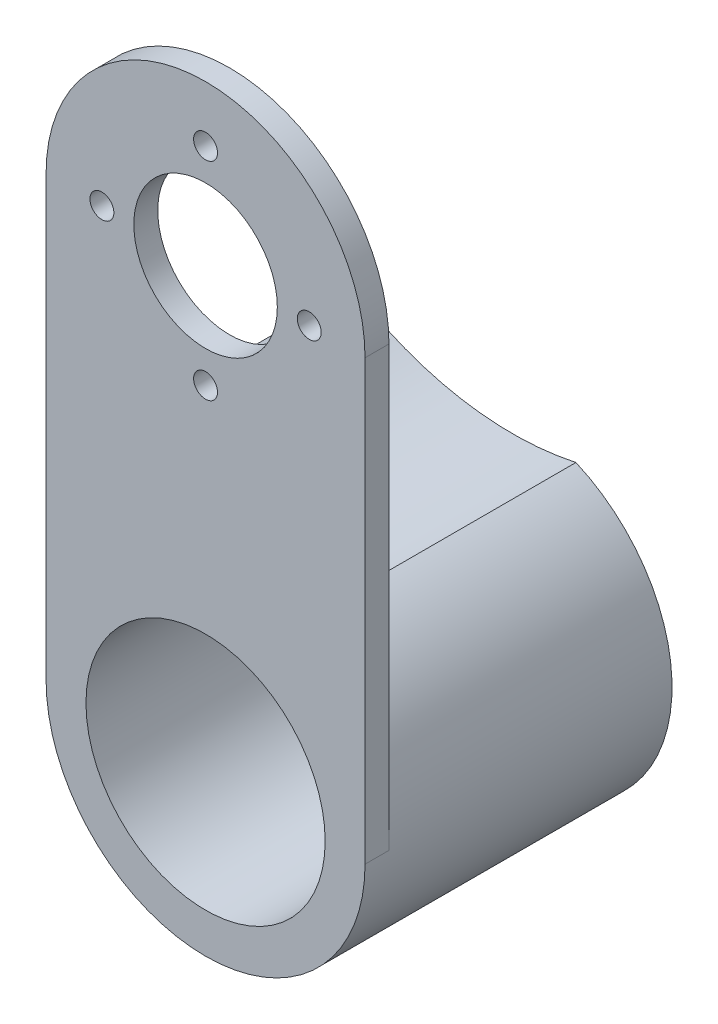
ISO-10303-21;
HEADER;
FILE_DESCRIPTION(('STEP AP214'),'2;1');
FILE_NAME('part.step','',(''),(''),'','','');
FILE_SCHEMA(('AUTOMOTIVE_DESIGN { 1 0 10303 214 1 1 1 1 }'));
ENDSEC;
DATA;
#1=APPLICATION_CONTEXT('core data for automotive mechanical design processes');
#2=APPLICATION_PROTOCOL_DEFINITION('international standard','automotive_design',2000,#1);
#3=PRODUCT_CONTEXT('',#1,'mechanical');
#4=PRODUCT('Part','Part','',(#3));
#5=PRODUCT_RELATED_PRODUCT_CATEGORY('part','',(#4));
#6=PRODUCT_DEFINITION_FORMATION('','',#4);
#7=PRODUCT_DEFINITION_CONTEXT('part definition',#1,'design');
#8=PRODUCT_DEFINITION('design','',#6,#7);
#9=PRODUCT_DEFINITION_SHAPE('','',#8);
#10=(LENGTH_UNIT() NAMED_UNIT(*) SI_UNIT(.MILLI.,.METRE.));
#11=(NAMED_UNIT(*) PLANE_ANGLE_UNIT() SI_UNIT($,.RADIAN.));
#12=(NAMED_UNIT(*) SI_UNIT($,.STERADIAN.) SOLID_ANGLE_UNIT());
#13=UNCERTAINTY_MEASURE_WITH_UNIT(LENGTH_MEASURE(1.E-05),#10,'distance_accuracy_value','');
#14=(GEOMETRIC_REPRESENTATION_CONTEXT(3) GLOBAL_UNCERTAINTY_ASSIGNED_CONTEXT((#13)) GLOBAL_UNIT_ASSIGNED_CONTEXT((#10,
#11,#12)) REPRESENTATION_CONTEXT('',''));
#15=CARTESIAN_POINT('',(0.,0.,0.));
#16=DIRECTION('',(0.,0.,1.));
#17=DIRECTION('',(1.,0.,0.));
#18=AXIS2_PLACEMENT_3D('',#15,#16,#17);
#19=CARTESIAN_POINT('',(20.,0.,-35.5));
#20=DIRECTION('',(0.,0.,1.));
#21=DIRECTION('',(1.,0.,0.));
#22=AXIS2_PLACEMENT_3D('',#19,#20,#21);
#23=CYLINDRICAL_SURFACE('',#22,9.);
#24=CARTESIAN_POINT('',(20.,0.,-35.5));
#25=DIRECTION('',(0.,0.,1.));
#26=DIRECTION('',(1.,0.,0.));
#27=AXIS2_PLACEMENT_3D('',#24,#25,#26);
#28=CIRCLE('',#27,9.);
#29=CARTESIAN_POINT('',(29.,0.,-35.5));
#30=VERTEX_POINT('',#29);
#31=EDGE_CURVE('E112',#30,#30,#28,.T.);
#32=ORIENTED_EDGE('',*,*,#31,.F.);
#33=EDGE_LOOP('',(#32));
#34=FACE_BOUND('',#33,.T.);
#35=CARTESIAN_POINT('',(20.,0.,-31.5));
#36=DIRECTION('',(0.,0.,1.));
#37=DIRECTION('',(1.,0.,0.));
#38=AXIS2_PLACEMENT_3D('',#35,#36,#37);
#39=CIRCLE('',#38,9.);
#40=CARTESIAN_POINT('',(29.,0.,-31.5));
#41=VERTEX_POINT('',#40);
#42=EDGE_CURVE('E35',#41,#41,#39,.F.);
#43=ORIENTED_EDGE('',*,*,#42,.F.);
#44=EDGE_LOOP('',(#43));
#45=FACE_BOUND('',#44,.T.);
#46=ADVANCED_FACE('F31',(#34,#45),#23,.F.);
#47=CARTESIAN_POINT('',(20.,0.,3.));
#48=DIRECTION('',(0.,0.,1.));
#49=DIRECTION('',(1.,0.,0.));
#50=AXIS2_PLACEMENT_3D('',#47,#48,#49);
#51=PLANE('',#50);
#52=CARTESIAN_POINT('',(20.,0.,3.));
#53=DIRECTION('',(0.,0.,1.));
#54=DIRECTION('',(1.,0.,0.));
#55=AXIS2_PLACEMENT_3D('',#52,#53,#54);
#56=CIRCLE('',#55,15.);
#57=CARTESIAN_POINT('',(35.,0.,3.));
#58=VERTEX_POINT('',#57);
#59=EDGE_CURVE('E352',#58,#58,#56,.T.);
#60=ORIENTED_EDGE('',*,*,#59,.F.);
#61=EDGE_LOOP('',(#60));
#62=FACE_BOUND('',#61,.T.);
#63=CARTESIAN_POINT('',(20.,0.,3.));
#64=DIRECTION('',(0.,0.,1.));
#65=DIRECTION('',(1.,0.,0.));
#66=AXIS2_PLACEMENT_3D('',#63,#64,#65);
#67=CIRCLE('',#66,20.);
#68=CARTESIAN_POINT('',(0.,0.,3.));
#69=VERTEX_POINT('',#68);
#70=CARTESIAN_POINT('',(40.,0.,3.));
#71=VERTEX_POINT('',#70);
#72=EDGE_CURVE('E154',#69,#71,#67,.T.);
#73=ORIENTED_EDGE('',*,*,#72,.T.);
#74=DIRECTION('',(0.,1.,0.));
#75=VECTOR('',#74,1.);
#76=CARTESIAN_POINT('',(40.,55.,3.));
#77=LINE('',#76,#75);
#78=CARTESIAN_POINT('',(40.,55.,3.));
#79=VERTEX_POINT('',#78);
#80=EDGE_CURVE('E79',#71,#79,#77,.T.);
#81=ORIENTED_EDGE('',*,*,#80,.T.);
#82=CARTESIAN_POINT('',(20.,55.,3.));
#83=DIRECTION('',(0.,0.,1.));
#84=DIRECTION('',(-1.,0.,0.));
#85=AXIS2_PLACEMENT_3D('',#82,#83,#84);
#86=CIRCLE('',#85,20.);
#87=CARTESIAN_POINT('',(0.,55.,3.));
#88=VERTEX_POINT('',#87);
#89=EDGE_CURVE('E158',#79,#88,#86,.T.);
#90=ORIENTED_EDGE('',*,*,#89,.T.);
#91=DIRECTION('',(0.,-1.,0.));
#92=VECTOR('',#91,1.);
#93=CARTESIAN_POINT('',(0.,0.,3.));
#94=LINE('',#93,#92);
#95=EDGE_CURVE('E56',#88,#69,#94,.T.);
#96=ORIENTED_EDGE('',*,*,#95,.T.);
#97=EDGE_LOOP('',(#73,#81,#90,#96));
#98=FACE_BOUND('',#97,.T.);
#99=CARTESIAN_POINT('',(7.,55.,3.));
#100=DIRECTION('',(0.,0.,1.));
#101=DIRECTION('',(1.,0.,0.));
#102=AXIS2_PLACEMENT_3D('',#99,#100,#101);
#103=CIRCLE('',#102,1.5);
#104=CARTESIAN_POINT('',(8.5,55.,3.));
#105=VERTEX_POINT('',#104);
#106=EDGE_CURVE('E130',#105,#105,#103,.T.);
#107=ORIENTED_EDGE('',*,*,#106,.F.);
#108=EDGE_LOOP('',(#107));
#109=FACE_BOUND('',#108,.T.);
#110=CARTESIAN_POINT('',(20.,68.,3.));
#111=DIRECTION('',(0.,0.,1.));
#112=DIRECTION('',(1.,0.,0.));
#113=AXIS2_PLACEMENT_3D('',#110,#111,#112);
#114=CIRCLE('',#113,1.5);
#115=CARTESIAN_POINT('',(21.5,68.,3.));
#116=VERTEX_POINT('',#115);
#117=EDGE_CURVE('E142',#116,#116,#114,.T.);
#118=ORIENTED_EDGE('',*,*,#117,.F.);
#119=EDGE_LOOP('',(#118));
#120=FACE_BOUND('',#119,.T.);
#121=CARTESIAN_POINT('',(20.,55.,3.));
#122=DIRECTION('',(0.,0.,1.));
#123=DIRECTION('',(1.,0.,0.));
#124=AXIS2_PLACEMENT_3D('',#121,#122,#123);
#125=CIRCLE('',#124,9.00000000000001);
#126=CARTESIAN_POINT('',(29.,55.,3.));
#127=VERTEX_POINT('',#126);
#128=EDGE_CURVE('E148',#127,#127,#125,.T.);
#129=ORIENTED_EDGE('',*,*,#128,.F.);
#130=EDGE_LOOP('',(#129));
#131=FACE_BOUND('',#130,.T.);
#132=CARTESIAN_POINT('',(20.,42.,3.));
#133=DIRECTION('',(0.,0.,1.));
#134=DIRECTION('',(-1.,0.,0.));
#135=AXIS2_PLACEMENT_3D('',#132,#133,#134);
#136=CIRCLE('',#135,1.5);
#137=CARTESIAN_POINT('',(18.5,42.,3.));
#138=VERTEX_POINT('',#137);
#139=EDGE_CURVE('E136',#138,#138,#136,.T.);
#140=ORIENTED_EDGE('',*,*,#139,.F.);
#141=EDGE_LOOP('',(#140));
#142=FACE_BOUND('',#141,.T.);
#143=CARTESIAN_POINT('',(33.,55.,3.));
#144=DIRECTION('',(0.,0.,1.));
#145=DIRECTION('',(-1.,0.,0.));
#146=AXIS2_PLACEMENT_3D('',#143,#144,#145);
#147=CIRCLE('',#146,1.5);
#148=CARTESIAN_POINT('',(31.5,55.,3.));
#149=VERTEX_POINT('',#148);
#150=EDGE_CURVE('E124',#149,#149,#147,.T.);
#151=ORIENTED_EDGE('',*,*,#150,.F.);
#152=EDGE_LOOP('',(#151));
#153=FACE_BOUND('',#152,.T.);
#154=ADVANCED_FACE('F178',(#62,#98,#109,#120,#131,#142,#153),#51,.T.);
#155=CARTESIAN_POINT('',(20.,0.,0.));
#156=DIRECTION('',(0.,0.,1.));
#157=DIRECTION('',(1.,0.,0.));
#158=AXIS2_PLACEMENT_3D('',#155,#156,#157);
#159=PLANE('',#158);
#160=CARTESIAN_POINT('',(7.,55.,0.));
#161=DIRECTION('',(0.,0.,1.));
#162=DIRECTION('',(1.,0.,0.));
#163=AXIS2_PLACEMENT_3D('',#160,#161,#162);
#164=CIRCLE('',#163,1.5);
#165=CARTESIAN_POINT('',(8.5,55.,0.));
#166=VERTEX_POINT('',#165);
#167=EDGE_CURVE('E127',#166,#166,#164,.T.);
#168=ORIENTED_EDGE('',*,*,#167,.T.);
#169=EDGE_LOOP('',(#168));
#170=FACE_BOUND('',#169,.T.);
#171=CARTESIAN_POINT('',(20.,68.,0.));
#172=DIRECTION('',(0.,0.,1.));
#173=DIRECTION('',(1.,0.,0.));
#174=AXIS2_PLACEMENT_3D('',#171,#172,#173);
#175=CIRCLE('',#174,1.5);
#176=CARTESIAN_POINT('',(21.5,68.,0.));
#177=VERTEX_POINT('',#176);
#178=EDGE_CURVE('E139',#177,#177,#175,.T.);
#179=ORIENTED_EDGE('',*,*,#178,.T.);
#180=EDGE_LOOP('',(#179));
#181=FACE_BOUND('',#180,.T.);
#182=CARTESIAN_POINT('',(20.,55.,0.));
#183=DIRECTION('',(0.,0.,1.));
#184=DIRECTION('',(1.,0.,0.));
#185=AXIS2_PLACEMENT_3D('',#182,#183,#184);
#186=CIRCLE('',#185,9.00000000000001);
#187=CARTESIAN_POINT('',(29.,55.,0.));
#188=VERTEX_POINT('',#187);
#189=EDGE_CURVE('E145',#188,#188,#186,.T.);
#190=ORIENTED_EDGE('',*,*,#189,.T.);
#191=EDGE_LOOP('',(#190));
#192=FACE_BOUND('',#191,.T.);
#193=DIRECTION('',(0.,1.,0.));
#194=VECTOR('',#193,1.);
#195=CARTESIAN_POINT('',(40.,55.,0.));
#196=LINE('',#195,#194);
#197=CARTESIAN_POINT('',(40.,0.,0.));
#198=VERTEX_POINT('',#197);
#199=CARTESIAN_POINT('',(40.,55.,0.));
#200=VERTEX_POINT('',#199);
#201=EDGE_CURVE('E151',#198,#200,#196,.T.);
#202=ORIENTED_EDGE('',*,*,#201,.F.);
#203=CARTESIAN_POINT('',(20.,0.,0.));
#204=DIRECTION('',(0.,0.,1.));
#205=DIRECTION('',(1.,0.,0.));
#206=AXIS2_PLACEMENT_3D('',#203,#204,#205);
#207=CIRCLE('',#206,20.);
#208=CARTESIAN_POINT('',(27.9494707838825,18.3522727272727,0.));
#209=VERTEX_POINT('',#208);
#210=EDGE_CURVE('E121',#198,#209,#207,.T.);
#211=ORIENTED_EDGE('',*,*,#210,.T.);
#212=CARTESIAN_POINT('',(20.,55.,0.));
#213=DIRECTION('',(0.,0.,1.));
#214=DIRECTION('',(1.,0.,0.));
#215=AXIS2_PLACEMENT_3D('',#212,#213,#214);
#216=CIRCLE('',#215,37.5);
#217=CARTESIAN_POINT('',(0.,23.2785561488762,0.));
#218=VERTEX_POINT('',#217);
#219=EDGE_CURVE('E98',#209,#218,#216,.F.);
#220=ORIENTED_EDGE('',*,*,#219,.T.);
#221=DIRECTION('',(0.,-1.,0.));
#222=VECTOR('',#221,1.);
#223=CARTESIAN_POINT('',(0.,0.,0.));
#224=LINE('',#223,#222);
#225=CARTESIAN_POINT('',(0.,55.,0.));
#226=VERTEX_POINT('',#225);
#227=EDGE_CURVE('E156',#226,#218,#224,.T.);
#228=ORIENTED_EDGE('',*,*,#227,.F.);
#229=CARTESIAN_POINT('',(20.,55.,0.));
#230=DIRECTION('',(0.,0.,1.));
#231=DIRECTION('',(-1.,0.,0.));
#232=AXIS2_PLACEMENT_3D('',#229,#230,#231);
#233=CIRCLE('',#232,20.);
#234=EDGE_CURVE('E72',#200,#226,#233,.T.);
#235=ORIENTED_EDGE('',*,*,#234,.F.);
#236=EDGE_LOOP('',(#202,#211,#220,#228,#235));
#237=FACE_BOUND('',#236,.T.);
#238=CARTESIAN_POINT('',(20.,42.,0.));
#239=DIRECTION('',(0.,0.,1.));
#240=DIRECTION('',(-1.,0.,0.));
#241=AXIS2_PLACEMENT_3D('',#238,#239,#240);
#242=CIRCLE('',#241,1.5);
#243=CARTESIAN_POINT('',(18.5,42.,0.));
#244=VERTEX_POINT('',#243);
#245=EDGE_CURVE('E133',#244,#244,#242,.T.);
#246=ORIENTED_EDGE('',*,*,#245,.T.);
#247=EDGE_LOOP('',(#246));
#248=FACE_BOUND('',#247,.T.);
#249=CARTESIAN_POINT('',(33.,55.,0.));
#250=DIRECTION('',(0.,0.,1.));
#251=DIRECTION('',(-1.,0.,0.));
#252=AXIS2_PLACEMENT_3D('',#249,#250,#251);
#253=CIRCLE('',#252,1.5);
#254=CARTESIAN_POINT('',(31.5,55.,0.));
#255=VERTEX_POINT('',#254);
#256=EDGE_CURVE('E123',#255,#255,#253,.T.);
#257=ORIENTED_EDGE('',*,*,#256,.T.);
#258=EDGE_LOOP('',(#257));
#259=FACE_BOUND('',#258,.T.);
#260=ADVANCED_FACE('F173',(#170,#181,#192,#237,#248,#259),#159,.F.);
#261=CARTESIAN_POINT('',(20.,0.,3.));
#262=DIRECTION('',(0.,0.,-1.));
#263=DIRECTION('',(-1.,0.,0.));
#264=AXIS2_PLACEMENT_3D('',#261,#262,#263);
#265=CYLINDRICAL_SURFACE('',#264,20.);
#266=DIRECTION('',(0.,0.,-1.));
#267=VECTOR('',#266,1.);
#268=CARTESIAN_POINT('',(0.,0.,3.));
#269=LINE('',#268,#267);
#270=CARTESIAN_POINT('',(0.,0.,-35.5));
#271=VERTEX_POINT('',#270);
#272=EDGE_CURVE('E111',#69,#271,#269,.T.);
#273=ORIENTED_EDGE('',*,*,#272,.T.);
#274=CARTESIAN_POINT('',(20.,0.,-35.5));
#275=DIRECTION('',(0.,0.,1.));
#276=DIRECTION('',(1.,0.,0.));
#277=AXIS2_PLACEMENT_3D('',#274,#275,#276);
#278=CIRCLE('',#277,20.);
#279=CARTESIAN_POINT('',(27.9494707838825,18.3522727272727,-35.5));
#280=VERTEX_POINT('',#279);
#281=EDGE_CURVE('E107',#271,#280,#278,.T.);
#282=ORIENTED_EDGE('',*,*,#281,.T.);
#283=DIRECTION('',(0.,0.,1.));
#284=VECTOR('',#283,1.);
#285=CARTESIAN_POINT('',(27.9494707838825,18.3522727272727,-35.5));
#286=LINE('',#285,#284);
#287=EDGE_CURVE('E93',#280,#209,#286,.T.);
#288=ORIENTED_EDGE('',*,*,#287,.T.);
#289=ORIENTED_EDGE('',*,*,#210,.F.);
#290=DIRECTION('',(0.,0.,-1.));
#291=VECTOR('',#290,1.);
#292=CARTESIAN_POINT('',(40.,0.,3.));
#293=LINE('',#292,#291);
#294=EDGE_CURVE('E11',#71,#198,#293,.T.);
#295=ORIENTED_EDGE('',*,*,#294,.F.);
#296=ORIENTED_EDGE('',*,*,#72,.F.);
#297=EDGE_LOOP('',(#273,#282,#288,#289,#295,#296));
#298=FACE_BOUND('',#297,.T.);
#299=ADVANCED_FACE('F33',(#298),#265,.T.);
#300=CARTESIAN_POINT('',(40.,55.,3.));
#301=DIRECTION('',(-1.,0.,0.));
#302=DIRECTION('',(0.,-1.,0.));
#303=AXIS2_PLACEMENT_3D('',#300,#301,#302);
#304=PLANE('',#303);
#305=ORIENTED_EDGE('',*,*,#201,.T.);
#306=DIRECTION('',(0.,0.,-1.));
#307=VECTOR('',#306,1.);
#308=CARTESIAN_POINT('',(40.,55.,3.));
#309=LINE('',#308,#307);
#310=EDGE_CURVE('E40',#79,#200,#309,.T.);
#311=ORIENTED_EDGE('',*,*,#310,.F.);
#312=ORIENTED_EDGE('',*,*,#80,.F.);
#313=ORIENTED_EDGE('',*,*,#294,.T.);
#314=EDGE_LOOP('',(#305,#311,#312,#313));
#315=FACE_BOUND('',#314,.T.);
#316=ADVANCED_FACE('F206',(#315),#304,.F.);
#317=CARTESIAN_POINT('',(20.,55.,3.));
#318=DIRECTION('',(0.,0.,-1.));
#319=DIRECTION('',(-1.,0.,0.));
#320=AXIS2_PLACEMENT_3D('',#317,#318,#319);
#321=CYLINDRICAL_SURFACE('',#320,20.);
#322=ORIENTED_EDGE('',*,*,#234,.T.);
#323=DIRECTION('',(0.,0.,-1.));
#324=VECTOR('',#323,1.);
#325=CARTESIAN_POINT('',(0.,55.,3.));
#326=LINE('',#325,#324);
#327=EDGE_CURVE('E166',#88,#226,#326,.T.);
#328=ORIENTED_EDGE('',*,*,#327,.F.);
#329=ORIENTED_EDGE('',*,*,#89,.F.);
#330=ORIENTED_EDGE('',*,*,#310,.T.);
#331=EDGE_LOOP('',(#322,#328,#329,#330));
#332=FACE_BOUND('',#331,.T.);
#333=ADVANCED_FACE('F169',(#332),#321,.T.);
#334=CARTESIAN_POINT('',(0.,0.,3.));
#335=DIRECTION('',(1.,0.,0.));
#336=DIRECTION('',(0.,0.,-1.));
#337=AXIS2_PLACEMENT_3D('',#334,#335,#336);
#338=PLANE('',#337);
#339=ORIENTED_EDGE('',*,*,#227,.T.);
#340=DIRECTION('',(0.,0.,1.));
#341=VECTOR('',#340,1.);
#342=CARTESIAN_POINT('',(0.,23.2785561488762,-35.5));
#343=LINE('',#342,#341);
#344=CARTESIAN_POINT('',(0.,23.2785561488762,-35.5));
#345=VERTEX_POINT('',#344);
#346=EDGE_CURVE('E47',#345,#218,#343,.T.);
#347=ORIENTED_EDGE('',*,*,#346,.F.);
#348=DIRECTION('',(0.,-1.,0.));
#349=VECTOR('',#348,1.);
#350=CARTESIAN_POINT('',(0.,0.,-35.5));
#351=LINE('',#350,#349);
#352=EDGE_CURVE('E102',#345,#271,#351,.T.);
#353=ORIENTED_EDGE('',*,*,#352,.T.);
#354=ORIENTED_EDGE('',*,*,#272,.F.);
#355=ORIENTED_EDGE('',*,*,#95,.F.);
#356=ORIENTED_EDGE('',*,*,#327,.T.);
#357=EDGE_LOOP('',(#339,#347,#353,#354,#355,#356));
#358=FACE_BOUND('',#357,.T.);
#359=ADVANCED_FACE('F176',(#358),#338,.F.);
#360=CARTESIAN_POINT('',(20.,55.,3.));
#361=DIRECTION('',(0.,0.,-1.));
#362=DIRECTION('',(-1.,0.,0.));
#363=AXIS2_PLACEMENT_3D('',#360,#361,#362);
#364=CYLINDRICAL_SURFACE('',#363,9.00000000000001);
#365=ORIENTED_EDGE('',*,*,#128,.T.);
#366=EDGE_LOOP('',(#365));
#367=FACE_BOUND('',#366,.T.);
#368=ORIENTED_EDGE('',*,*,#189,.F.);
#369=EDGE_LOOP('',(#368));
#370=FACE_BOUND('',#369,.T.);
#371=ADVANCED_FACE('F236',(#367,#370),#364,.F.);
#372=CARTESIAN_POINT('',(20.,68.,3.));
#373=DIRECTION('',(0.,0.,-1.));
#374=DIRECTION('',(-1.,0.,0.));
#375=AXIS2_PLACEMENT_3D('',#372,#373,#374);
#376=CYLINDRICAL_SURFACE('',#375,1.5);
#377=ORIENTED_EDGE('',*,*,#117,.T.);
#378=EDGE_LOOP('',(#377));
#379=FACE_BOUND('',#378,.T.);
#380=ORIENTED_EDGE('',*,*,#178,.F.);
#381=EDGE_LOOP('',(#380));
#382=FACE_BOUND('',#381,.T.);
#383=ADVANCED_FACE('F232',(#379,#382),#376,.F.);
#384=CARTESIAN_POINT('',(20.,42.,3.));
#385=DIRECTION('',(0.,0.,-1.));
#386=DIRECTION('',(-1.,0.,0.));
#387=AXIS2_PLACEMENT_3D('',#384,#385,#386);
#388=CYLINDRICAL_SURFACE('',#387,1.5);
#389=ORIENTED_EDGE('',*,*,#139,.T.);
#390=EDGE_LOOP('',(#389));
#391=FACE_BOUND('',#390,.T.);
#392=ORIENTED_EDGE('',*,*,#245,.F.);
#393=EDGE_LOOP('',(#392));
#394=FACE_BOUND('',#393,.T.);
#395=ADVANCED_FACE('F228',(#391,#394),#388,.F.);
#396=CARTESIAN_POINT('',(7.,55.,3.));
#397=DIRECTION('',(0.,0.,-1.));
#398=DIRECTION('',(-1.,0.,0.));
#399=AXIS2_PLACEMENT_3D('',#396,#397,#398);
#400=CYLINDRICAL_SURFACE('',#399,1.5);
#401=ORIENTED_EDGE('',*,*,#106,.T.);
#402=EDGE_LOOP('',(#401));
#403=FACE_BOUND('',#402,.T.);
#404=ORIENTED_EDGE('',*,*,#167,.F.);
#405=EDGE_LOOP('',(#404));
#406=FACE_BOUND('',#405,.T.);
#407=ADVANCED_FACE('F196',(#403,#406),#400,.F.);
#408=CARTESIAN_POINT('',(33.,55.,3.));
#409=DIRECTION('',(0.,0.,-1.));
#410=DIRECTION('',(-1.,0.,0.));
#411=AXIS2_PLACEMENT_3D('',#408,#409,#410);
#412=CYLINDRICAL_SURFACE('',#411,1.5);
#413=ORIENTED_EDGE('',*,*,#150,.T.);
#414=EDGE_LOOP('',(#413));
#415=FACE_BOUND('',#414,.T.);
#416=ORIENTED_EDGE('',*,*,#256,.F.);
#417=EDGE_LOOP('',(#416));
#418=FACE_BOUND('',#417,.T.);
#419=ADVANCED_FACE('F193',(#415,#418),#412,.F.);
#420=CARTESIAN_POINT('',(20.,55.,-35.5));
#421=DIRECTION('',(0.,0.,1.));
#422=DIRECTION('',(1.,0.,0.));
#423=AXIS2_PLACEMENT_3D('',#420,#421,#422);
#424=CYLINDRICAL_SURFACE('',#423,37.5);
#425=ORIENTED_EDGE('',*,*,#219,.F.);
#426=ORIENTED_EDGE('',*,*,#287,.F.);
#427=CARTESIAN_POINT('',(20.,55.,-35.5));
#428=DIRECTION('',(0.,0.,-1.));
#429=DIRECTION('',(1.,0.,0.));
#430=AXIS2_PLACEMENT_3D('',#427,#428,#429);
#431=CIRCLE('',#430,37.5);
#432=EDGE_CURVE('E96',#280,#345,#431,.T.);
#433=ORIENTED_EDGE('',*,*,#432,.T.);
#434=ORIENTED_EDGE('',*,*,#346,.T.);
#435=EDGE_LOOP('',(#425,#426,#433,#434));
#436=FACE_BOUND('',#435,.T.);
#437=ADVANCED_FACE('F95',(#436),#424,.F.);
#438=CARTESIAN_POINT('',(20.,0.,-35.5));
#439=DIRECTION('',(0.,0.,1.));
#440=DIRECTION('',(1.,0.,0.));
#441=AXIS2_PLACEMENT_3D('',#438,#439,#440);
#442=PLANE('',#441);
#443=ORIENTED_EDGE('',*,*,#31,.T.);
#444=EDGE_LOOP('',(#443));
#445=FACE_BOUND('',#444,.T.);
#446=ORIENTED_EDGE('',*,*,#281,.F.);
#447=ORIENTED_EDGE('',*,*,#352,.F.);
#448=ORIENTED_EDGE('',*,*,#432,.F.);
#449=EDGE_LOOP('',(#446,#447,#448));
#450=FACE_BOUND('',#449,.T.);
#451=ADVANCED_FACE('F106',(#445,#450),#442,.F.);
#452=CARTESIAN_POINT('',(20.,0.,-31.5));
#453=DIRECTION('',(0.,0.,1.));
#454=DIRECTION('',(1.,0.,0.));
#455=AXIS2_PLACEMENT_3D('',#452,#453,#454);
#456=PLANE('',#455);
#457=CARTESIAN_POINT('',(20.,0.,-31.5));
#458=DIRECTION('',(0.,0.,1.));
#459=DIRECTION('',(1.,0.,0.));
#460=AXIS2_PLACEMENT_3D('',#457,#458,#459);
#461=CIRCLE('',#460,15.);
#462=CARTESIAN_POINT('',(35.,0.,-31.5));
#463=VERTEX_POINT('',#462);
#464=EDGE_CURVE('E349',#463,#463,#461,.T.);
#465=ORIENTED_EDGE('',*,*,#464,.T.);
#466=EDGE_LOOP('',(#465));
#467=FACE_BOUND('',#466,.T.);
#468=ORIENTED_EDGE('',*,*,#42,.T.);
#469=EDGE_LOOP('',(#468));
#470=FACE_BOUND('',#469,.T.);
#471=ADVANCED_FACE('F222',(#467,#470),#456,.T.);
#472=CARTESIAN_POINT('',(20.,0.,-31.5));
#473=DIRECTION('',(0.,0.,1.));
#474=DIRECTION('',(1.,0.,0.));
#475=AXIS2_PLACEMENT_3D('',#472,#473,#474);
#476=CYLINDRICAL_SURFACE('',#475,15.);
#477=ORIENTED_EDGE('',*,*,#464,.F.);
#478=EDGE_LOOP('',(#477));
#479=FACE_BOUND('',#478,.T.);
#480=ORIENTED_EDGE('',*,*,#59,.T.);
#481=EDGE_LOOP('',(#480));
#482=FACE_BOUND('',#481,.T.);
#483=ADVANCED_FACE('F218',(#479,#482),#476,.F.);
#484=CLOSED_SHELL('',(#46,#154,#260,#299,#316,#333,#359,#371,#383,#395,#407,#419,#437,#451,#471,#483));
#485=MANIFOLD_SOLID_BREP('B2',#484);
#486=ADVANCED_BREP_SHAPE_REPRESENTATION('',(#18,#485),#14);
#487=SHAPE_DEFINITION_REPRESENTATION(#9,#486);
ENDSEC;
END-ISO-10303-21;
